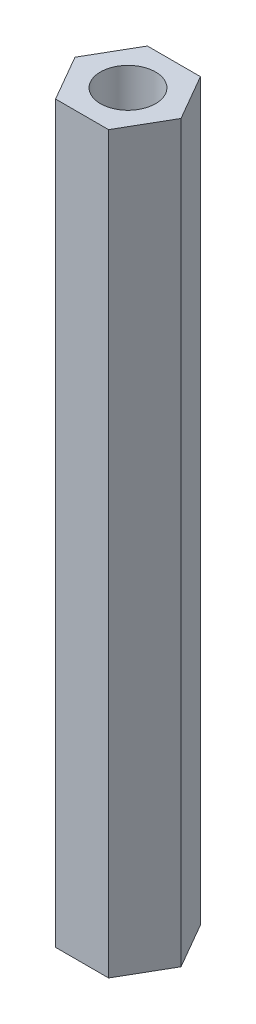
ISO-10303-21;
HEADER;
FILE_DESCRIPTION(('STEP AP214'),'2;1');
FILE_NAME('part.step','',(''),(''),'','','');
FILE_SCHEMA(('AUTOMOTIVE_DESIGN { 1 0 10303 214 1 1 1 1 }'));
ENDSEC;
DATA;
#1=APPLICATION_CONTEXT('core data for automotive mechanical design processes');
#2=APPLICATION_PROTOCOL_DEFINITION('international standard','automotive_design',2000,#1);
#3=PRODUCT_CONTEXT('',#1,'mechanical');
#4=PRODUCT('Part','Part','',(#3));
#5=PRODUCT_RELATED_PRODUCT_CATEGORY('part','',(#4));
#6=PRODUCT_DEFINITION_FORMATION('','',#4);
#7=PRODUCT_DEFINITION_CONTEXT('part definition',#1,'design');
#8=PRODUCT_DEFINITION('design','',#6,#7);
#9=PRODUCT_DEFINITION_SHAPE('','',#8);
#10=(LENGTH_UNIT() NAMED_UNIT(*) SI_UNIT(.MILLI.,.METRE.));
#11=(NAMED_UNIT(*) PLANE_ANGLE_UNIT() SI_UNIT($,.RADIAN.));
#12=(NAMED_UNIT(*) SI_UNIT($,.STERADIAN.) SOLID_ANGLE_UNIT());
#13=UNCERTAINTY_MEASURE_WITH_UNIT(LENGTH_MEASURE(1.E-05),#10,'distance_accuracy_value','');
#14=(GEOMETRIC_REPRESENTATION_CONTEXT(3) GLOBAL_UNCERTAINTY_ASSIGNED_CONTEXT((#13)) GLOBAL_UNIT_ASSIGNED_CONTEXT((#10,
#11,#12)) REPRESENTATION_CONTEXT('',''));
#15=CARTESIAN_POINT('',(0.,0.,0.));
#16=DIRECTION('',(0.,0.,1.));
#17=DIRECTION('',(1.,0.,0.));
#18=AXIS2_PLACEMENT_3D('',#15,#16,#17);
#19=CARTESIAN_POINT('',(-117.109887718177,744.292319552453,163.417570962768));
#20=DIRECTION('',(-0.866025403838329,0.,-0.499999999906659));
#21=DIRECTION('',(-0.499999999906659,0.,0.866025403838329));
#22=AXIS2_PLACEMENT_3D('',#19,#20,#21);
#23=PLANE('',#22);
#24=DIRECTION('',(0.500000000006738,0.,-0.866025403780548));
#25=VECTOR('',#24,1.);
#26=CARTESIAN_POINT('',(-117.109887718177,729.292319552453,163.417570962768));
#27=LINE('',#26,#25);
#28=CARTESIAN_POINT('',(-117.109887718177,729.292319552453,163.417570962768));
#29=VERTEX_POINT('',#28);
#30=CARTESIAN_POINT('',(-115.666512045177,729.292319552453,160.917570962768));
#31=VERTEX_POINT('',#30);
#32=EDGE_CURVE('E12',#29,#31,#27,.T.);
#33=ORIENTED_EDGE('',*,*,#32,.T.);
#34=DIRECTION('',(0.,-1.,0.));
#35=VECTOR('',#34,1.);
#36=CARTESIAN_POINT('',(-115.666512045177,744.292319552453,160.917570962768));
#37=LINE('',#36,#35);
#38=CARTESIAN_POINT('',(-115.666512045177,769.292319552453,160.917570962768));
#39=VERTEX_POINT('',#38);
#40=EDGE_CURVE('E57',#39,#31,#37,.T.);
#41=ORIENTED_EDGE('',*,*,#40,.F.);
#42=DIRECTION('',(0.500000000006738,0.,-0.866025403780549));
#43=VECTOR('',#42,1.);
#44=CARTESIAN_POINT('',(-117.109887718177,769.292319552453,163.417570962768));
#45=LINE('',#44,#43);
#46=CARTESIAN_POINT('',(-117.109887718177,769.292319552453,163.417570962768));
#47=VERTEX_POINT('',#46);
#48=EDGE_CURVE('E112',#47,#39,#45,.T.);
#49=ORIENTED_EDGE('',*,*,#48,.F.);
#50=DIRECTION('',(0.,-1.,0.));
#51=VECTOR('',#50,1.);
#52=CARTESIAN_POINT('',(-117.109887718177,744.292319552453,163.417570962768));
#53=LINE('',#52,#51);
#54=EDGE_CURVE('E48',#47,#29,#53,.T.);
#55=ORIENTED_EDGE('',*,*,#54,.T.);
#56=EDGE_LOOP('',(#33,#41,#49,#55));
#57=FACE_BOUND('',#56,.T.);
#58=ADVANCED_FACE('F37',(#57),#23,.F.);
#59=CARTESIAN_POINT('',(-115.666512045177,744.292319552453,160.917570962768));
#60=DIRECTION('',(-0.866025403838329,0.,0.499999999906659));
#61=DIRECTION('',(0.499999999906659,0.,0.866025403838329));
#62=AXIS2_PLACEMENT_3D('',#59,#60,#61);
#63=PLANE('',#62);
#64=DIRECTION('',(-0.500000000006738,0.,-0.866025403780548));
#65=VECTOR('',#64,1.);
#66=CARTESIAN_POINT('',(-115.666512045177,729.292319552453,160.917570962768));
#67=LINE('',#66,#65);
#68=CARTESIAN_POINT('',(-117.109887718177,729.292319552453,158.417570962768));
#69=VERTEX_POINT('',#68);
#70=EDGE_CURVE('E109',#31,#69,#67,.T.);
#71=ORIENTED_EDGE('',*,*,#70,.T.);
#72=DIRECTION('',(0.,-1.,0.));
#73=VECTOR('',#72,1.);
#74=CARTESIAN_POINT('',(-117.109887718177,744.292319552453,158.417570962768));
#75=LINE('',#74,#73);
#76=CARTESIAN_POINT('',(-117.109887718177,769.292319552453,158.417570962768));
#77=VERTEX_POINT('',#76);
#78=EDGE_CURVE('E72',#77,#69,#75,.T.);
#79=ORIENTED_EDGE('',*,*,#78,.F.);
#80=DIRECTION('',(-0.500000000006738,0.,-0.866025403780549));
#81=VECTOR('',#80,1.);
#82=CARTESIAN_POINT('',(-115.666512045177,769.292319552453,160.917570962768));
#83=LINE('',#82,#81);
#84=EDGE_CURVE('E115',#39,#77,#83,.T.);
#85=ORIENTED_EDGE('',*,*,#84,.F.);
#86=ORIENTED_EDGE('',*,*,#40,.T.);
#87=EDGE_LOOP('',(#71,#79,#85,#86));
#88=FACE_BOUND('',#87,.T.);
#89=ADVANCED_FACE('F185',(#88),#63,.F.);
#90=CARTESIAN_POINT('',(-117.109887718177,744.292319552453,158.417570962768));
#91=DIRECTION('',(0.,0.,1.));
#92=DIRECTION('',(1.,0.,0.));
#93=AXIS2_PLACEMENT_3D('',#90,#91,#92);
#94=PLANE('',#93);
#95=DIRECTION('',(-1.,0.,0.));
#96=VECTOR('',#95,1.);
#97=CARTESIAN_POINT('',(-117.109887718177,729.292319552453,158.417570962768));
#98=LINE('',#97,#96);
#99=CARTESIAN_POINT('',(-119.996639064177,729.292319552453,158.417570962768));
#100=VERTEX_POINT('',#99);
#101=EDGE_CURVE('E150',#69,#100,#98,.T.);
#102=ORIENTED_EDGE('',*,*,#101,.T.);
#103=DIRECTION('',(0.,-1.,0.));
#104=VECTOR('',#103,1.);
#105=CARTESIAN_POINT('',(-119.996639064177,744.292319552453,158.417570962768));
#106=LINE('',#105,#104);
#107=CARTESIAN_POINT('',(-119.996639064177,769.292319552453,158.417570962768));
#108=VERTEX_POINT('',#107);
#109=EDGE_CURVE('E78',#108,#100,#106,.T.);
#110=ORIENTED_EDGE('',*,*,#109,.F.);
#111=DIRECTION('',(-1.,0.,0.));
#112=VECTOR('',#111,1.);
#113=CARTESIAN_POINT('',(-117.109887718177,769.292319552453,158.417570962768));
#114=LINE('',#113,#112);
#115=EDGE_CURVE('E129',#77,#108,#114,.T.);
#116=ORIENTED_EDGE('',*,*,#115,.F.);
#117=ORIENTED_EDGE('',*,*,#78,.T.);
#118=EDGE_LOOP('',(#102,#110,#116,#117));
#119=FACE_BOUND('',#118,.T.);
#120=ADVANCED_FACE('F186',(#119),#94,.F.);
#121=CARTESIAN_POINT('',(-119.996639064177,744.292319552453,158.417570962768));
#122=DIRECTION('',(0.866025403838329,0.,0.499999999906659));
#123=DIRECTION('',(0.499999999906659,0.,-0.866025403838329));
#124=AXIS2_PLACEMENT_3D('',#121,#122,#123);
#125=PLANE('',#124);
#126=DIRECTION('',(-0.500000000006738,0.,0.866025403780548));
#127=VECTOR('',#126,1.);
#128=CARTESIAN_POINT('',(-119.996639064177,729.292319552453,158.417570962768));
#129=LINE('',#128,#127);
#130=CARTESIAN_POINT('',(-121.440014737177,729.292319552453,160.917570962768));
#131=VERTEX_POINT('',#130);
#132=EDGE_CURVE('E41',#100,#131,#129,.T.);
#133=ORIENTED_EDGE('',*,*,#132,.T.);
#134=DIRECTION('',(0.,-1.,0.));
#135=VECTOR('',#134,1.);
#136=CARTESIAN_POINT('',(-121.440014737177,744.292319552453,160.917570962768));
#137=LINE('',#136,#135);
#138=CARTESIAN_POINT('',(-121.440014737177,769.292319552453,160.917570962768));
#139=VERTEX_POINT('',#138);
#140=EDGE_CURVE('E84',#139,#131,#137,.T.);
#141=ORIENTED_EDGE('',*,*,#140,.F.);
#142=DIRECTION('',(-0.500000000006738,0.,0.866025403780549));
#143=VECTOR('',#142,1.);
#144=CARTESIAN_POINT('',(-119.996639064177,769.292319552453,158.417570962768));
#145=LINE('',#144,#143);
#146=EDGE_CURVE('E132',#108,#139,#145,.T.);
#147=ORIENTED_EDGE('',*,*,#146,.F.);
#148=ORIENTED_EDGE('',*,*,#109,.T.);
#149=EDGE_LOOP('',(#133,#141,#147,#148));
#150=FACE_BOUND('',#149,.T.);
#151=ADVANCED_FACE('F187',(#150),#125,.F.);
#152=CARTESIAN_POINT('',(-121.440014737177,744.292319552453,160.917570962768));
#153=DIRECTION('',(0.866025403838329,0.,-0.499999999906659));
#154=DIRECTION('',(-0.499999999906659,0.,-0.866025403838329));
#155=AXIS2_PLACEMENT_3D('',#152,#153,#154);
#156=PLANE('',#155);
#157=DIRECTION('',(0.500000000006738,0.,0.866025403780548));
#158=VECTOR('',#157,1.);
#159=CARTESIAN_POINT('',(-121.440014737177,729.292319552453,160.917570962768));
#160=LINE('',#159,#158);
#161=CARTESIAN_POINT('',(-119.996639064177,729.292319552453,163.417570962768));
#162=VERTEX_POINT('',#161);
#163=EDGE_CURVE('E152',#131,#162,#160,.T.);
#164=ORIENTED_EDGE('',*,*,#163,.T.);
#165=DIRECTION('',(0.,-1.,0.));
#166=VECTOR('',#165,1.);
#167=CARTESIAN_POINT('',(-119.996639064177,744.292319552453,163.417570962768));
#168=LINE('',#167,#166);
#169=CARTESIAN_POINT('',(-119.996639064177,769.292319552453,163.417570962768));
#170=VERTEX_POINT('',#169);
#171=EDGE_CURVE('E134',#170,#162,#168,.T.);
#172=ORIENTED_EDGE('',*,*,#171,.F.);
#173=DIRECTION('',(0.500000000006738,0.,0.866025403780549));
#174=VECTOR('',#173,1.);
#175=CARTESIAN_POINT('',(-121.440014737177,769.292319552453,160.917570962768));
#176=LINE('',#175,#174);
#177=EDGE_CURVE('E120',#139,#170,#176,.T.);
#178=ORIENTED_EDGE('',*,*,#177,.F.);
#179=ORIENTED_EDGE('',*,*,#140,.T.);
#180=EDGE_LOOP('',(#164,#172,#178,#179));
#181=FACE_BOUND('',#180,.T.);
#182=ADVANCED_FACE('F180',(#181),#156,.F.);
#183=CARTESIAN_POINT('',(-119.996639064177,744.292319552453,163.417570962768));
#184=DIRECTION('',(0.,0.,-1.));
#185=DIRECTION('',(-1.,0.,0.));
#186=AXIS2_PLACEMENT_3D('',#183,#184,#185);
#187=PLANE('',#186);
#188=DIRECTION('',(1.,0.,0.));
#189=VECTOR('',#188,1.);
#190=CARTESIAN_POINT('',(-119.996639064177,729.292319552453,163.417570962768));
#191=LINE('',#190,#189);
#192=EDGE_CURVE('E106',#162,#29,#191,.T.);
#193=ORIENTED_EDGE('',*,*,#192,.T.);
#194=ORIENTED_EDGE('',*,*,#54,.F.);
#195=DIRECTION('',(1.,0.,0.));
#196=VECTOR('',#195,1.);
#197=CARTESIAN_POINT('',(-119.996639064177,769.292319552453,163.417570962768));
#198=LINE('',#197,#196);
#199=EDGE_CURVE('E104',#170,#47,#198,.T.);
#200=ORIENTED_EDGE('',*,*,#199,.F.);
#201=ORIENTED_EDGE('',*,*,#171,.T.);
#202=EDGE_LOOP('',(#193,#194,#200,#201));
#203=FACE_BOUND('',#202,.T.);
#204=ADVANCED_FACE('F102',(#203),#187,.F.);
#205=CARTESIAN_POINT('',(-118.553263391177,729.292319552453,160.917570962768));
#206=DIRECTION('',(0.,1.,0.));
#207=DIRECTION('',(0.,0.,1.));
#208=AXIS2_PLACEMENT_3D('',#205,#206,#207);
#209=PLANE('',#208);
#210=CARTESIAN_POINT('',(-118.553263391177,729.292319552453,160.917570962768));
#211=DIRECTION('',(0.,1.,0.));
#212=DIRECTION('',(0.,0.,1.));
#213=AXIS2_PLACEMENT_3D('',#210,#211,#212);
#214=CIRCLE('',#213,1.5);
#215=CARTESIAN_POINT('',(-118.553263391177,729.292319552453,162.417570962768));
#216=VERTEX_POINT('',#215);
#217=EDGE_CURVE('E121',#216,#216,#214,.F.);
#218=ORIENTED_EDGE('',*,*,#217,.F.);
#219=EDGE_LOOP('',(#218));
#220=FACE_BOUND('',#219,.T.);
#221=ORIENTED_EDGE('',*,*,#32,.F.);
#222=ORIENTED_EDGE('',*,*,#192,.F.);
#223=ORIENTED_EDGE('',*,*,#163,.F.);
#224=ORIENTED_EDGE('',*,*,#132,.F.);
#225=ORIENTED_EDGE('',*,*,#101,.F.);
#226=ORIENTED_EDGE('',*,*,#70,.F.);
#227=EDGE_LOOP('',(#221,#222,#223,#224,#225,#226));
#228=FACE_BOUND('',#227,.T.);
#229=ADVANCED_FACE('F39',(#220,#228),#209,.F.);
#230=CARTESIAN_POINT('',(0.,769.292319552453,0.));
#231=DIRECTION('',(0.,1.,0.));
#232=DIRECTION('',(0.,0.,1.));
#233=AXIS2_PLACEMENT_3D('',#230,#231,#232);
#234=PLANE('',#233);
#235=CARTESIAN_POINT('',(-118.553263391177,769.292319552453,160.917570962768));
#236=DIRECTION('',(0.,1.,0.));
#237=DIRECTION('',(0.,0.,1.));
#238=AXIS2_PLACEMENT_3D('',#235,#236,#237);
#239=CIRCLE('',#238,1.5);
#240=CARTESIAN_POINT('',(-118.553263391177,769.292319552453,162.417570962768));
#241=VERTEX_POINT('',#240);
#242=EDGE_CURVE('E124',#241,#241,#239,.T.);
#243=ORIENTED_EDGE('',*,*,#242,.F.);
#244=EDGE_LOOP('',(#243));
#245=FACE_BOUND('',#244,.T.);
#246=ORIENTED_EDGE('',*,*,#199,.T.);
#247=ORIENTED_EDGE('',*,*,#48,.T.);
#248=ORIENTED_EDGE('',*,*,#84,.T.);
#249=ORIENTED_EDGE('',*,*,#115,.T.);
#250=ORIENTED_EDGE('',*,*,#146,.T.);
#251=ORIENTED_EDGE('',*,*,#177,.T.);
#252=EDGE_LOOP('',(#246,#247,#248,#249,#250,#251));
#253=FACE_BOUND('',#252,.T.);
#254=ADVANCED_FACE('F118',(#245,#253),#234,.T.);
#255=CARTESIAN_POINT('',(-118.553263391177,725.049678865334,160.917570962768));
#256=DIRECTION('',(0.,1.,0.));
#257=DIRECTION('',(0.,0.,1.));
#258=AXIS2_PLACEMENT_3D('',#255,#256,#257);
#259=CYLINDRICAL_SURFACE('',#258,1.5);
#260=ORIENTED_EDGE('',*,*,#217,.T.);
#261=EDGE_LOOP('',(#260));
#262=FACE_BOUND('',#261,.T.);
#263=ORIENTED_EDGE('',*,*,#242,.T.);
#264=EDGE_LOOP('',(#263));
#265=FACE_BOUND('',#264,.T.);
#266=ADVANCED_FACE('F210',(#262,#265),#259,.F.);
#267=CLOSED_SHELL('',(#58,#89,#120,#151,#182,#204,#229,#254,#266));
#268=MANIFOLD_SOLID_BREP('B2',#267);
#269=ADVANCED_BREP_SHAPE_REPRESENTATION('',(#18,#268),#14);
#270=SHAPE_DEFINITION_REPRESENTATION(#9,#269);
ENDSEC;
END-ISO-10303-21;
